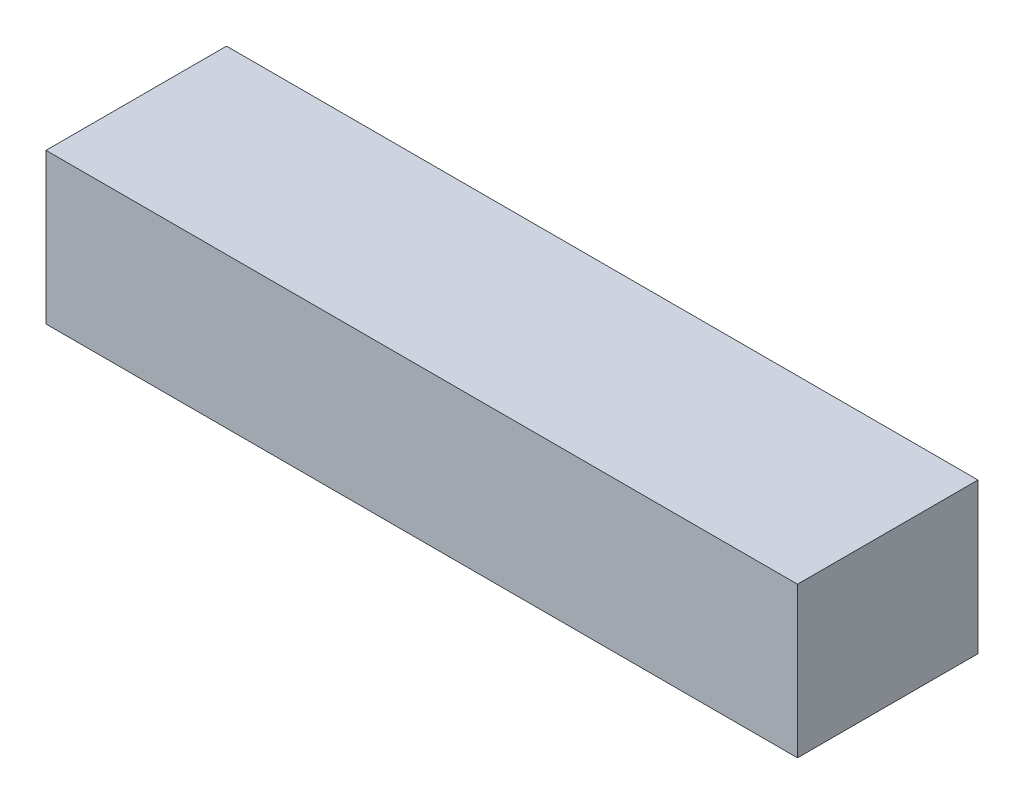
ISO-10303-21;
HEADER;
FILE_DESCRIPTION(('STEP AP214'),'2;1');
FILE_NAME('part.step','',(''),(''),'','','');
FILE_SCHEMA(('AUTOMOTIVE_DESIGN { 1 0 10303 214 1 1 1 1 }'));
ENDSEC;
DATA;
#1=APPLICATION_CONTEXT('core data for automotive mechanical design processes');
#2=APPLICATION_PROTOCOL_DEFINITION('international standard','automotive_design',2000,#1);
#3=PRODUCT_CONTEXT('',#1,'mechanical');
#4=PRODUCT('Part','Part','',(#3));
#5=PRODUCT_RELATED_PRODUCT_CATEGORY('part','',(#4));
#6=PRODUCT_DEFINITION_FORMATION('','',#4);
#7=PRODUCT_DEFINITION_CONTEXT('part definition',#1,'design');
#8=PRODUCT_DEFINITION('design','',#6,#7);
#9=PRODUCT_DEFINITION_SHAPE('','',#8);
#10=(LENGTH_UNIT() NAMED_UNIT(*) SI_UNIT(.MILLI.,.METRE.));
#11=(NAMED_UNIT(*) PLANE_ANGLE_UNIT() SI_UNIT($,.RADIAN.));
#12=(NAMED_UNIT(*) SI_UNIT($,.STERADIAN.) SOLID_ANGLE_UNIT());
#13=UNCERTAINTY_MEASURE_WITH_UNIT(LENGTH_MEASURE(1.E-05),#10,'distance_accuracy_value','');
#14=(GEOMETRIC_REPRESENTATION_CONTEXT(3) GLOBAL_UNCERTAINTY_ASSIGNED_CONTEXT((#13)) GLOBAL_UNIT_ASSIGNED_CONTEXT((#10,
#11,#12)) REPRESENTATION_CONTEXT('',''));
#15=CARTESIAN_POINT('',(0.,0.,0.));
#16=DIRECTION('',(0.,0.,1.));
#17=DIRECTION('',(1.,0.,0.));
#18=AXIS2_PLACEMENT_3D('',#15,#16,#17);
#19=CARTESIAN_POINT('',(-11.1756987611389,1.40496124031008,6.));
#20=DIRECTION('',(1.,0.,0.));
#21=DIRECTION('',(0.,0.,-1.));
#22=AXIS2_PLACEMENT_3D('',#19,#20,#21);
#23=PLANE('',#22);
#24=DIRECTION('',(0.,-1.,0.));
#25=VECTOR('',#24,1.);
#26=CARTESIAN_POINT('',(-11.1756987611389,1.40496124031008,0.));
#27=LINE('',#26,#25);
#28=CARTESIAN_POINT('',(-11.1756987611389,1.40496124031008,0.));
#29=VERTEX_POINT('',#28);
#30=CARTESIAN_POINT('',(-11.1756987611389,-3.59503875968992,0.));
#31=VERTEX_POINT('',#30);
#32=EDGE_CURVE('E95',#29,#31,#27,.T.);
#33=ORIENTED_EDGE('',*,*,#32,.T.);
#34=DIRECTION('',(0.,0.,-1.));
#35=VECTOR('',#34,1.);
#36=CARTESIAN_POINT('',(-11.1756987611389,-3.59503875968992,6.));
#37=LINE('',#36,#35);
#38=CARTESIAN_POINT('',(-11.1756987611389,-3.59503875968992,6.));
#39=VERTEX_POINT('',#38);
#40=EDGE_CURVE('E11',#39,#31,#37,.T.);
#41=ORIENTED_EDGE('',*,*,#40,.F.);
#42=DIRECTION('',(0.,-1.,0.));
#43=VECTOR('',#42,1.);
#44=CARTESIAN_POINT('',(-11.1756987611389,1.40496124031008,6.));
#45=LINE('',#44,#43);
#46=CARTESIAN_POINT('',(-11.1756987611389,1.40496124031008,6.));
#47=VERTEX_POINT('',#46);
#48=EDGE_CURVE('E83',#47,#39,#45,.T.);
#49=ORIENTED_EDGE('',*,*,#48,.F.);
#50=DIRECTION('',(0.,0.,-1.));
#51=VECTOR('',#50,1.);
#52=CARTESIAN_POINT('',(-11.1756987611389,1.40496124031008,6.));
#53=LINE('',#52,#51);
#54=EDGE_CURVE('E91',#47,#29,#53,.T.);
#55=ORIENTED_EDGE('',*,*,#54,.T.);
#56=EDGE_LOOP('',(#33,#41,#49,#55));
#57=FACE_BOUND('',#56,.T.);
#58=ADVANCED_FACE('F32',(#57),#23,.F.);
#59=CARTESIAN_POINT('',(-11.1756987611389,-3.59503875968992,6.));
#60=DIRECTION('',(0.,1.,0.));
#61=DIRECTION('',(0.,0.,1.));
#62=AXIS2_PLACEMENT_3D('',#59,#60,#61);
#63=PLANE('',#62);
#64=DIRECTION('',(1.,0.,0.));
#65=VECTOR('',#64,1.);
#66=CARTESIAN_POINT('',(-11.1756987611389,-3.59503875968992,0.));
#67=LINE('',#66,#65);
#68=CARTESIAN_POINT('',(13.8043012388611,-3.59503875968992,0.));
#69=VERTEX_POINT('',#68);
#70=EDGE_CURVE('E87',#31,#69,#67,.T.);
#71=ORIENTED_EDGE('',*,*,#70,.T.);
#72=DIRECTION('',(0.,0.,-1.));
#73=VECTOR('',#72,1.);
#74=CARTESIAN_POINT('',(13.8043012388611,-3.59503875968992,6.));
#75=LINE('',#74,#73);
#76=CARTESIAN_POINT('',(13.8043012388611,-3.59503875968992,6.));
#77=VERTEX_POINT('',#76);
#78=EDGE_CURVE('E40',#77,#69,#75,.T.);
#79=ORIENTED_EDGE('',*,*,#78,.F.);
#80=DIRECTION('',(1.,0.,0.));
#81=VECTOR('',#80,1.);
#82=CARTESIAN_POINT('',(-11.1756987611389,-3.59503875968992,6.));
#83=LINE('',#82,#81);
#84=EDGE_CURVE('E78',#39,#77,#83,.T.);
#85=ORIENTED_EDGE('',*,*,#84,.F.);
#86=ORIENTED_EDGE('',*,*,#40,.T.);
#87=EDGE_LOOP('',(#71,#79,#85,#86));
#88=FACE_BOUND('',#87,.T.);
#89=ADVANCED_FACE('F86',(#88),#63,.F.);
#90=CARTESIAN_POINT('',(13.8043012388611,1.40496124031008,6.));
#91=DIRECTION('',(-1.,0.,0.));
#92=DIRECTION('',(0.,0.,1.));
#93=AXIS2_PLACEMENT_3D('',#90,#91,#92);
#94=PLANE('',#93);
#95=DIRECTION('',(0.,1.,0.));
#96=VECTOR('',#95,1.);
#97=CARTESIAN_POINT('',(13.8043012388611,1.40496124031008,0.));
#98=LINE('',#97,#96);
#99=CARTESIAN_POINT('',(13.8043012388611,1.40496124031008,0.));
#100=VERTEX_POINT('',#99);
#101=EDGE_CURVE('E65',#69,#100,#98,.T.);
#102=ORIENTED_EDGE('',*,*,#101,.T.);
#103=DIRECTION('',(0.,0.,-1.));
#104=VECTOR('',#103,1.);
#105=CARTESIAN_POINT('',(13.8043012388611,1.40496124031008,6.));
#106=LINE('',#105,#104);
#107=CARTESIAN_POINT('',(13.8043012388611,1.40496124031008,6.));
#108=VERTEX_POINT('',#107);
#109=EDGE_CURVE('E88',#108,#100,#106,.T.);
#110=ORIENTED_EDGE('',*,*,#109,.F.);
#111=DIRECTION('',(0.,1.,0.));
#112=VECTOR('',#111,1.);
#113=CARTESIAN_POINT('',(13.8043012388611,1.40496124031008,6.));
#114=LINE('',#113,#112);
#115=EDGE_CURVE('E81',#77,#108,#114,.T.);
#116=ORIENTED_EDGE('',*,*,#115,.F.);
#117=ORIENTED_EDGE('',*,*,#78,.T.);
#118=EDGE_LOOP('',(#102,#110,#116,#117));
#119=FACE_BOUND('',#118,.T.);
#120=ADVANCED_FACE('F89',(#119),#94,.F.);
#121=CARTESIAN_POINT('',(-11.1756987611389,1.40496124031008,6.));
#122=DIRECTION('',(0.,-1.,0.));
#123=DIRECTION('',(0.,0.,-1.));
#124=AXIS2_PLACEMENT_3D('',#121,#122,#123);
#125=PLANE('',#124);
#126=DIRECTION('',(-1.,0.,0.));
#127=VECTOR('',#126,1.);
#128=CARTESIAN_POINT('',(-11.1756987611389,1.40496124031008,0.));
#129=LINE('',#128,#127);
#130=EDGE_CURVE('E71',#100,#29,#129,.T.);
#131=ORIENTED_EDGE('',*,*,#130,.T.);
#132=ORIENTED_EDGE('',*,*,#54,.F.);
#133=DIRECTION('',(-1.,0.,0.));
#134=VECTOR('',#133,1.);
#135=CARTESIAN_POINT('',(-11.1756987611389,1.40496124031008,6.));
#136=LINE('',#135,#134);
#137=EDGE_CURVE('E48',#108,#47,#136,.T.);
#138=ORIENTED_EDGE('',*,*,#137,.F.);
#139=ORIENTED_EDGE('',*,*,#109,.T.);
#140=EDGE_LOOP('',(#131,#132,#138,#139));
#141=FACE_BOUND('',#140,.T.);
#142=ADVANCED_FACE('F102',(#141),#125,.F.);
#143=CARTESIAN_POINT('',(0.,0.,6.));
#144=DIRECTION('',(0.,0.,1.));
#145=DIRECTION('',(1.,0.,0.));
#146=AXIS2_PLACEMENT_3D('',#143,#144,#145);
#147=PLANE('',#146);
#148=ORIENTED_EDGE('',*,*,#48,.T.);
#149=ORIENTED_EDGE('',*,*,#84,.T.);
#150=ORIENTED_EDGE('',*,*,#115,.T.);
#151=ORIENTED_EDGE('',*,*,#137,.T.);
#152=EDGE_LOOP('',(#148,#149,#150,#151));
#153=FACE_BOUND('',#152,.T.);
#154=ADVANCED_FACE('F79',(#153),#147,.T.);
#155=CARTESIAN_POINT('',(0.,0.,0.));
#156=DIRECTION('',(0.,0.,1.));
#157=DIRECTION('',(1.,0.,0.));
#158=AXIS2_PLACEMENT_3D('',#155,#156,#157);
#159=PLANE('',#158);
#160=ORIENTED_EDGE('',*,*,#32,.F.);
#161=ORIENTED_EDGE('',*,*,#130,.F.);
#162=ORIENTED_EDGE('',*,*,#101,.F.);
#163=ORIENTED_EDGE('',*,*,#70,.F.);
#164=EDGE_LOOP('',(#160,#161,#162,#163));
#165=FACE_BOUND('',#164,.T.);
#166=ADVANCED_FACE('F105',(#165),#159,.F.);
#167=CLOSED_SHELL('',(#58,#89,#120,#142,#154,#166));
#168=MANIFOLD_SOLID_BREP('B2',#167);
#169=ADVANCED_BREP_SHAPE_REPRESENTATION('',(#18,#168),#14);
#170=SHAPE_DEFINITION_REPRESENTATION(#9,#169);
ENDSEC;
END-ISO-10303-21;
